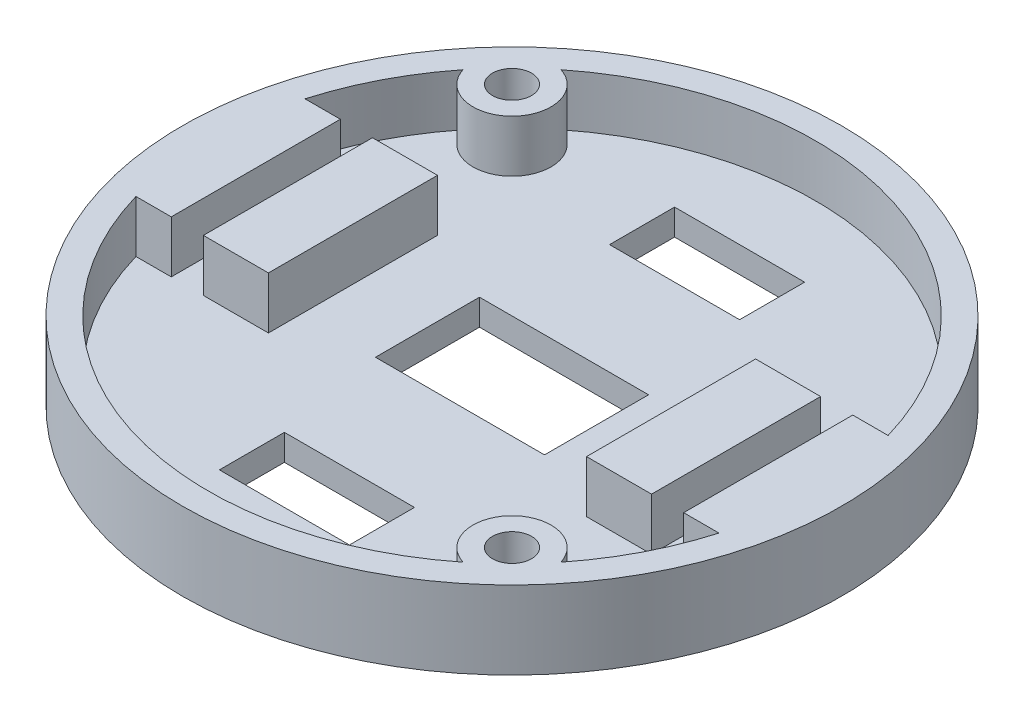
ISO-10303-21;
HEADER;
FILE_DESCRIPTION(('STEP AP214'),'2;1');
FILE_NAME('part.step','',(''),(''),'','','');
FILE_SCHEMA(('AUTOMOTIVE_DESIGN { 1 0 10303 214 1 1 1 1 }'));
ENDSEC;
DATA;
#1=APPLICATION_CONTEXT('core data for automotive mechanical design processes');
#2=APPLICATION_PROTOCOL_DEFINITION('international standard','automotive_design',2000,#1);
#3=PRODUCT_CONTEXT('',#1,'mechanical');
#4=PRODUCT('Part','Part','',(#3));
#5=PRODUCT_RELATED_PRODUCT_CATEGORY('part','',(#4));
#6=PRODUCT_DEFINITION_FORMATION('','',#4);
#7=PRODUCT_DEFINITION_CONTEXT('part definition',#1,'design');
#8=PRODUCT_DEFINITION('design','',#6,#7);
#9=PRODUCT_DEFINITION_SHAPE('','',#8);
#10=(LENGTH_UNIT() NAMED_UNIT(*) SI_UNIT(.MILLI.,.METRE.));
#11=(NAMED_UNIT(*) PLANE_ANGLE_UNIT() SI_UNIT($,.RADIAN.));
#12=(NAMED_UNIT(*) SI_UNIT($,.STERADIAN.) SOLID_ANGLE_UNIT());
#13=UNCERTAINTY_MEASURE_WITH_UNIT(LENGTH_MEASURE(1.E-05),#10,'distance_accuracy_value','');
#14=(GEOMETRIC_REPRESENTATION_CONTEXT(3) GLOBAL_UNCERTAINTY_ASSIGNED_CONTEXT((#13)) GLOBAL_UNIT_ASSIGNED_CONTEXT((#10,
#11,#12)) REPRESENTATION_CONTEXT('',''));
#15=CARTESIAN_POINT('',(0.,0.,0.));
#16=DIRECTION('',(0.,0.,1.));
#17=DIRECTION('',(1.,0.,0.));
#18=AXIS2_PLACEMENT_3D('',#15,#16,#17);
#19=CARTESIAN_POINT('',(0.,2.,0.));
#20=DIRECTION('',(0.,1.,0.));
#21=DIRECTION('',(0.,0.,1.));
#22=AXIS2_PLACEMENT_3D('',#19,#20,#21);
#23=PLANE('',#22);
#24=CARTESIAN_POINT('',(0.,2.,0.));
#25=DIRECTION('',(0.,1.,0.));
#26=DIRECTION('',(0.,0.,1.));
#27=AXIS2_PLACEMENT_3D('',#24,#25,#26);
#28=CIRCLE('',#27,23.34);
#29=CARTESIAN_POINT('',(-22.4166366790382,2.,6.5));
#30=VERTEX_POINT('',#29);
#31=CARTESIAN_POINT('',(14.5113899119544,2.,18.2804584959795));
#32=VERTEX_POINT('',#31);
#33=EDGE_CURVE('E569',#30,#32,#28,.T.);
#34=ORIENTED_EDGE('',*,*,#33,.T.);
#35=CARTESIAN_POINT('',(15.4219988976786,2.,15.4219988976786));
#36=DIRECTION('',(0.,-1.,0.));
#37=DIRECTION('',(0.,0.,1.));
#38=AXIS2_PLACEMENT_3D('',#35,#36,#37);
#39=CIRCLE('',#38,2.99999999999999);
#40=CARTESIAN_POINT('',(18.2804584959794,2.,14.5113899119544));
#41=VERTEX_POINT('',#40);
#42=EDGE_CURVE('E568',#32,#41,#39,.T.);
#43=ORIENTED_EDGE('',*,*,#42,.T.);
#44=CARTESIAN_POINT('',(0.,2.,0.));
#45=DIRECTION('',(0.,1.,0.));
#46=DIRECTION('',(0.,0.,1.));
#47=AXIS2_PLACEMENT_3D('',#44,#45,#46);
#48=CIRCLE('',#47,23.34);
#49=CARTESIAN_POINT('',(22.4166366790382,2.,6.5));
#50=VERTEX_POINT('',#49);
#51=EDGE_CURVE('E562',#41,#50,#48,.T.);
#52=ORIENTED_EDGE('',*,*,#51,.T.);
#53=DIRECTION('',(1.,0.,0.));
#54=VECTOR('',#53,1.);
#55=CARTESIAN_POINT('',(19.7,2.,6.5));
#56=LINE('',#55,#54);
#57=CARTESIAN_POINT('',(19.7,2.,6.5));
#58=VERTEX_POINT('',#57);
#59=EDGE_CURVE('E454',#58,#50,#56,.T.);
#60=ORIENTED_EDGE('',*,*,#59,.F.);
#61=DIRECTION('',(0.,0.,1.));
#62=VECTOR('',#61,1.);
#63=CARTESIAN_POINT('',(19.7,2.,-6.5));
#64=LINE('',#63,#62);
#65=CARTESIAN_POINT('',(19.7,2.,-6.5));
#66=VERTEX_POINT('',#65);
#67=EDGE_CURVE('E457',#66,#58,#64,.T.);
#68=ORIENTED_EDGE('',*,*,#67,.F.);
#69=DIRECTION('',(-1.,0.,0.));
#70=VECTOR('',#69,1.);
#71=CARTESIAN_POINT('',(22.4166366790382,2.,-6.5));
#72=LINE('',#71,#70);
#73=CARTESIAN_POINT('',(22.4166366790382,2.,-6.5));
#74=VERTEX_POINT('',#73);
#75=EDGE_CURVE('E461',#74,#66,#72,.T.);
#76=ORIENTED_EDGE('',*,*,#75,.F.);
#77=CARTESIAN_POINT('',(-14.5113899119544,2.,-18.2804584959795));
#78=VERTEX_POINT('',#77);
#79=EDGE_CURVE('E572',#74,#78,#48,.T.);
#80=ORIENTED_EDGE('',*,*,#79,.T.);
#81=CARTESIAN_POINT('',(-15.4219988976786,2.,-15.4219988976786));
#82=DIRECTION('',(0.,-1.,0.));
#83=DIRECTION('',(0.,0.,1.));
#84=AXIS2_PLACEMENT_3D('',#81,#82,#83);
#85=CIRCLE('',#84,3.);
#86=CARTESIAN_POINT('',(-18.2804584959794,2.,-14.5113899119544));
#87=VERTEX_POINT('',#86);
#88=EDGE_CURVE('E275',#78,#87,#85,.T.);
#89=ORIENTED_EDGE('',*,*,#88,.T.);
#90=CARTESIAN_POINT('',(-22.4166366790382,2.,-6.50000000000001));
#91=VERTEX_POINT('',#90);
#92=EDGE_CURVE('E565',#87,#91,#28,.T.);
#93=ORIENTED_EDGE('',*,*,#92,.T.);
#94=DIRECTION('',(-1.,0.,0.));
#95=VECTOR('',#94,1.);
#96=CARTESIAN_POINT('',(-22.4166366790382,2.,-6.5));
#97=LINE('',#96,#95);
#98=CARTESIAN_POINT('',(-19.7,2.,-6.49999999999999));
#99=VERTEX_POINT('',#98);
#100=EDGE_CURVE('E433',#99,#91,#97,.T.);
#101=ORIENTED_EDGE('',*,*,#100,.F.);
#102=DIRECTION('',(0.,0.,-1.));
#103=VECTOR('',#102,1.);
#104=CARTESIAN_POINT('',(-19.7,2.,-6.49999999999999));
#105=LINE('',#104,#103);
#106=CARTESIAN_POINT('',(-19.7,2.,6.5));
#107=VERTEX_POINT('',#106);
#108=EDGE_CURVE('E437',#107,#99,#105,.T.);
#109=ORIENTED_EDGE('',*,*,#108,.F.);
#110=DIRECTION('',(1.,0.,0.));
#111=VECTOR('',#110,1.);
#112=CARTESIAN_POINT('',(-19.7,2.,6.5));
#113=LINE('',#112,#111);
#114=EDGE_CURVE('E431',#30,#107,#113,.T.);
#115=ORIENTED_EDGE('',*,*,#114,.F.);
#116=EDGE_LOOP('',(#34,#43,#52,#60,#68,#76,#80,#89,#93,#101,#109,#115));
#117=FACE_BOUND('',#116,.T.);
#118=DIRECTION('',(0.,0.,1.));
#119=VECTOR('',#118,1.);
#120=CARTESIAN_POINT('',(-5.,2.,-17.5));
#121=LINE('',#120,#119);
#122=CARTESIAN_POINT('',(-5.,2.,-17.5));
#123=VERTEX_POINT('',#122);
#124=CARTESIAN_POINT('',(-5.,2.,-12.5));
#125=VERTEX_POINT('',#124);
#126=EDGE_CURVE('E56',#123,#125,#121,.T.);
#127=ORIENTED_EDGE('',*,*,#126,.F.);
#128=DIRECTION('',(-1.,0.,0.));
#129=VECTOR('',#128,1.);
#130=CARTESIAN_POINT('',(5.,2.,-17.5));
#131=LINE('',#130,#129);
#132=CARTESIAN_POINT('',(5.,2.,-17.5));
#133=VERTEX_POINT('',#132);
#134=EDGE_CURVE('E298',#133,#123,#131,.T.);
#135=ORIENTED_EDGE('',*,*,#134,.F.);
#136=DIRECTION('',(0.,0.,-1.));
#137=VECTOR('',#136,1.);
#138=CARTESIAN_POINT('',(5.,2.,-17.5));
#139=LINE('',#138,#137);
#140=CARTESIAN_POINT('',(5.,2.,-12.5));
#141=VERTEX_POINT('',#140);
#142=EDGE_CURVE('E312',#141,#133,#139,.T.);
#143=ORIENTED_EDGE('',*,*,#142,.F.);
#144=DIRECTION('',(1.,0.,0.));
#145=VECTOR('',#144,1.);
#146=CARTESIAN_POINT('',(5.,2.,-12.5));
#147=LINE('',#146,#145);
#148=EDGE_CURVE('E309',#125,#141,#147,.T.);
#149=ORIENTED_EDGE('',*,*,#148,.F.);
#150=EDGE_LOOP('',(#127,#135,#143,#149));
#151=FACE_BOUND('',#150,.T.);
#152=DIRECTION('',(0.,0.,-1.));
#153=VECTOR('',#152,1.);
#154=CARTESIAN_POINT('',(5.,2.,17.5));
#155=LINE('',#154,#153);
#156=CARTESIAN_POINT('',(5.,2.,17.5));
#157=VERTEX_POINT('',#156);
#158=CARTESIAN_POINT('',(5.,2.,12.5));
#159=VERTEX_POINT('',#158);
#160=EDGE_CURVE('E64',#157,#159,#155,.T.);
#161=ORIENTED_EDGE('',*,*,#160,.F.);
#162=DIRECTION('',(1.,0.,0.));
#163=VECTOR('',#162,1.);
#164=CARTESIAN_POINT('',(5.,2.,17.5));
#165=LINE('',#164,#163);
#166=CARTESIAN_POINT('',(-5.,2.,17.5));
#167=VERTEX_POINT('',#166);
#168=EDGE_CURVE('E335',#167,#157,#165,.T.);
#169=ORIENTED_EDGE('',*,*,#168,.F.);
#170=DIRECTION('',(0.,0.,1.));
#171=VECTOR('',#170,1.);
#172=CARTESIAN_POINT('',(-5.,2.,17.5));
#173=LINE('',#172,#171);
#174=CARTESIAN_POINT('',(-5.,2.,12.5));
#175=VERTEX_POINT('',#174);
#176=EDGE_CURVE('E338',#175,#167,#173,.T.);
#177=ORIENTED_EDGE('',*,*,#176,.F.);
#178=DIRECTION('',(-1.,0.,0.));
#179=VECTOR('',#178,1.);
#180=CARTESIAN_POINT('',(5.,2.,12.5));
#181=LINE('',#180,#179);
#182=EDGE_CURVE('E342',#159,#175,#181,.T.);
#183=ORIENTED_EDGE('',*,*,#182,.F.);
#184=EDGE_LOOP('',(#161,#169,#177,#183));
#185=FACE_BOUND('',#184,.T.);
#186=DIRECTION('',(0.,0.,1.));
#187=VECTOR('',#186,1.);
#188=CARTESIAN_POINT('',(-6.5,2.,-4.));
#189=LINE('',#188,#187);
#190=CARTESIAN_POINT('',(-6.5,2.,-4.));
#191=VERTEX_POINT('',#190);
#192=CARTESIAN_POINT('',(-6.5,2.,4.));
#193=VERTEX_POINT('',#192);
#194=EDGE_CURVE('E334',#191,#193,#189,.T.);
#195=ORIENTED_EDGE('',*,*,#194,.F.);
#196=DIRECTION('',(-1.,0.,0.));
#197=VECTOR('',#196,1.);
#198=CARTESIAN_POINT('',(6.5,2.,-4.));
#199=LINE('',#198,#197);
#200=CARTESIAN_POINT('',(6.5,2.,-4.));
#201=VERTEX_POINT('',#200);
#202=EDGE_CURVE('E365',#201,#191,#199,.T.);
#203=ORIENTED_EDGE('',*,*,#202,.F.);
#204=DIRECTION('',(0.,0.,-1.));
#205=VECTOR('',#204,1.);
#206=CARTESIAN_POINT('',(6.5,2.,-4.));
#207=LINE('',#206,#205);
#208=CARTESIAN_POINT('',(6.5,2.,4.));
#209=VERTEX_POINT('',#208);
#210=EDGE_CURVE('E368',#209,#201,#207,.T.);
#211=ORIENTED_EDGE('',*,*,#210,.F.);
#212=DIRECTION('',(1.,0.,0.));
#213=VECTOR('',#212,1.);
#214=CARTESIAN_POINT('',(6.5,2.,4.));
#215=LINE('',#214,#213);
#216=EDGE_CURVE('E372',#193,#209,#215,.T.);
#217=ORIENTED_EDGE('',*,*,#216,.F.);
#218=EDGE_LOOP('',(#195,#203,#211,#217));
#219=FACE_BOUND('',#218,.T.);
#220=DIRECTION('',(1.,0.,0.));
#221=VECTOR('',#220,1.);
#222=CARTESIAN_POINT('',(12.23,2.,6.5));
#223=LINE('',#222,#221);
#224=CARTESIAN_POINT('',(12.23,2.,6.5));
#225=VERTEX_POINT('',#224);
#226=CARTESIAN_POINT('',(17.23,2.,6.5));
#227=VERTEX_POINT('',#226);
#228=EDGE_CURVE('E481',#225,#227,#223,.T.);
#229=ORIENTED_EDGE('',*,*,#228,.F.);
#230=DIRECTION('',(0.,0.,1.));
#231=VECTOR('',#230,1.);
#232=CARTESIAN_POINT('',(12.23,2.,6.5));
#233=LINE('',#232,#231);
#234=CARTESIAN_POINT('',(12.23,2.,-6.5));
#235=VERTEX_POINT('',#234);
#236=EDGE_CURVE('E463',#235,#225,#233,.T.);
#237=ORIENTED_EDGE('',*,*,#236,.F.);
#238=DIRECTION('',(-1.,0.,0.));
#239=VECTOR('',#238,1.);
#240=CARTESIAN_POINT('',(12.23,2.,-6.5));
#241=LINE('',#240,#239);
#242=CARTESIAN_POINT('',(17.23,2.,-6.5));
#243=VERTEX_POINT('',#242);
#244=EDGE_CURVE('E472',#243,#235,#241,.T.);
#245=ORIENTED_EDGE('',*,*,#244,.F.);
#246=DIRECTION('',(0.,0.,-1.));
#247=VECTOR('',#246,1.);
#248=CARTESIAN_POINT('',(17.23,2.,6.5));
#249=LINE('',#248,#247);
#250=EDGE_CURVE('E483',#227,#243,#249,.T.);
#251=ORIENTED_EDGE('',*,*,#250,.F.);
#252=EDGE_LOOP('',(#229,#237,#245,#251));
#253=FACE_BOUND('',#252,.T.);
#254=DIRECTION('',(-1.,0.,0.));
#255=VECTOR('',#254,1.);
#256=CARTESIAN_POINT('',(-12.23,2.,-6.49999999999999));
#257=LINE('',#256,#255);
#258=CARTESIAN_POINT('',(-12.23,2.,-6.49999999999999));
#259=VERTEX_POINT('',#258);
#260=CARTESIAN_POINT('',(-17.23,2.,-6.49999999999999));
#261=VERTEX_POINT('',#260);
#262=EDGE_CURVE('E408',#259,#261,#257,.T.);
#263=ORIENTED_EDGE('',*,*,#262,.F.);
#264=DIRECTION('',(0.,0.,-1.));
#265=VECTOR('',#264,1.);
#266=CARTESIAN_POINT('',(-12.23,2.,6.5));
#267=LINE('',#266,#265);
#268=CARTESIAN_POINT('',(-12.23,2.,6.5));
#269=VERTEX_POINT('',#268);
#270=EDGE_CURVE('E410',#269,#259,#267,.T.);
#271=ORIENTED_EDGE('',*,*,#270,.F.);
#272=DIRECTION('',(1.,0.,0.));
#273=VECTOR('',#272,1.);
#274=CARTESIAN_POINT('',(-12.23,2.,6.5));
#275=LINE('',#274,#273);
#276=CARTESIAN_POINT('',(-17.23,2.,6.5));
#277=VERTEX_POINT('',#276);
#278=EDGE_CURVE('E402',#277,#269,#275,.T.);
#279=ORIENTED_EDGE('',*,*,#278,.F.);
#280=DIRECTION('',(0.,0.,1.));
#281=VECTOR('',#280,1.);
#282=CARTESIAN_POINT('',(-17.23,2.,6.5));
#283=LINE('',#282,#281);
#284=EDGE_CURVE('E404',#261,#277,#283,.T.);
#285=ORIENTED_EDGE('',*,*,#284,.F.);
#286=EDGE_LOOP('',(#263,#271,#279,#285));
#287=FACE_BOUND('',#286,.T.);
#288=ADVANCED_FACE('F41',(#117,#151,#185,#219,#253,#287),#23,.T.);
#289=CARTESIAN_POINT('',(0.,2.,0.));
#290=DIRECTION('',(0.,-1.,0.));
#291=DIRECTION('',(0.,0.,-1.));
#292=AXIS2_PLACEMENT_3D('',#289,#290,#291);
#293=CYLINDRICAL_SURFACE('',#292,25.34);
#294=CARTESIAN_POINT('',(0.,0.,0.));
#295=DIRECTION('',(0.,1.,0.));
#296=DIRECTION('',(0.,0.,1.));
#297=AXIS2_PLACEMENT_3D('',#294,#295,#296);
#298=CIRCLE('',#297,25.34);
#299=CARTESIAN_POINT('',(0.,0.,25.34));
#300=VERTEX_POINT('',#299);
#301=EDGE_CURVE('E11',#300,#300,#298,.T.);
#302=ORIENTED_EDGE('',*,*,#301,.T.);
#303=EDGE_LOOP('',(#302));
#304=FACE_BOUND('',#303,.T.);
#305=CARTESIAN_POINT('',(0.,6.00000000000001,0.));
#306=DIRECTION('',(0.,-1.,0.));
#307=DIRECTION('',(0.,0.,-1.));
#308=AXIS2_PLACEMENT_3D('',#305,#306,#307);
#309=CIRCLE('',#308,25.34);
#310=CARTESIAN_POINT('',(0.,6.00000000000001,-25.34));
#311=VERTEX_POINT('',#310);
#312=EDGE_CURVE('E559',#311,#311,#309,.T.);
#313=ORIENTED_EDGE('',*,*,#312,.T.);
#314=EDGE_LOOP('',(#313));
#315=FACE_BOUND('',#314,.T.);
#316=ADVANCED_FACE('F43',(#304,#315),#293,.T.);
#317=CARTESIAN_POINT('',(0.,0.,0.));
#318=DIRECTION('',(0.,1.,0.));
#319=DIRECTION('',(0.,0.,1.));
#320=AXIS2_PLACEMENT_3D('',#317,#318,#319);
#321=PLANE('',#320);
#322=DIRECTION('',(-1.,0.,0.));
#323=VECTOR('',#322,1.);
#324=CARTESIAN_POINT('',(5.,0.,-17.5));
#325=LINE('',#324,#323);
#326=CARTESIAN_POINT('',(5.,0.,-17.5));
#327=VERTEX_POINT('',#326);
#328=CARTESIAN_POINT('',(-5.,0.,-17.5));
#329=VERTEX_POINT('',#328);
#330=EDGE_CURVE('E304',#327,#329,#325,.T.);
#331=ORIENTED_EDGE('',*,*,#330,.T.);
#332=DIRECTION('',(0.,0.,1.));
#333=VECTOR('',#332,1.);
#334=CARTESIAN_POINT('',(-5.,0.,-17.5));
#335=LINE('',#334,#333);
#336=CARTESIAN_POINT('',(-5.,0.,-12.5));
#337=VERTEX_POINT('',#336);
#338=EDGE_CURVE('E294',#329,#337,#335,.T.);
#339=ORIENTED_EDGE('',*,*,#338,.T.);
#340=DIRECTION('',(1.,0.,0.));
#341=VECTOR('',#340,1.);
#342=CARTESIAN_POINT('',(5.,0.,-12.5));
#343=LINE('',#342,#341);
#344=CARTESIAN_POINT('',(5.,0.,-12.5));
#345=VERTEX_POINT('',#344);
#346=EDGE_CURVE('E297',#337,#345,#343,.T.);
#347=ORIENTED_EDGE('',*,*,#346,.T.);
#348=DIRECTION('',(0.,0.,-1.));
#349=VECTOR('',#348,1.);
#350=CARTESIAN_POINT('',(5.,0.,-17.5));
#351=LINE('',#350,#349);
#352=EDGE_CURVE('E301',#345,#327,#351,.T.);
#353=ORIENTED_EDGE('',*,*,#352,.T.);
#354=EDGE_LOOP('',(#331,#339,#347,#353));
#355=FACE_BOUND('',#354,.T.);
#356=DIRECTION('',(1.,0.,0.));
#357=VECTOR('',#356,1.);
#358=CARTESIAN_POINT('',(5.,0.,17.5));
#359=LINE('',#358,#357);
#360=CARTESIAN_POINT('',(-5.,0.,17.5));
#361=VERTEX_POINT('',#360);
#362=CARTESIAN_POINT('',(5.,0.,17.5));
#363=VERTEX_POINT('',#362);
#364=EDGE_CURVE('E327',#361,#363,#359,.T.);
#365=ORIENTED_EDGE('',*,*,#364,.T.);
#366=DIRECTION('',(0.,0.,-1.));
#367=VECTOR('',#366,1.);
#368=CARTESIAN_POINT('',(5.,0.,17.5));
#369=LINE('',#368,#367);
#370=CARTESIAN_POINT('',(5.,0.,12.5));
#371=VERTEX_POINT('',#370);
#372=EDGE_CURVE('E339',#363,#371,#369,.T.);
#373=ORIENTED_EDGE('',*,*,#372,.T.);
#374=DIRECTION('',(-1.,0.,0.));
#375=VECTOR('',#374,1.);
#376=CARTESIAN_POINT('',(5.,0.,12.5));
#377=LINE('',#376,#375);
#378=CARTESIAN_POINT('',(-5.,0.,12.5));
#379=VERTEX_POINT('',#378);
#380=EDGE_CURVE('E351',#371,#379,#377,.T.);
#381=ORIENTED_EDGE('',*,*,#380,.T.);
#382=DIRECTION('',(0.,0.,1.));
#383=VECTOR('',#382,1.);
#384=CARTESIAN_POINT('',(-5.,0.,17.5));
#385=LINE('',#384,#383);
#386=EDGE_CURVE('E348',#379,#361,#385,.T.);
#387=ORIENTED_EDGE('',*,*,#386,.T.);
#388=EDGE_LOOP('',(#365,#373,#381,#387));
#389=FACE_BOUND('',#388,.T.);
#390=DIRECTION('',(-1.,0.,0.));
#391=VECTOR('',#390,1.);
#392=CARTESIAN_POINT('',(6.5,0.,-4.));
#393=LINE('',#392,#391);
#394=CARTESIAN_POINT('',(6.5,0.,-4.));
#395=VERTEX_POINT('',#394);
#396=CARTESIAN_POINT('',(-6.5,0.,-4.));
#397=VERTEX_POINT('',#396);
#398=EDGE_CURVE('E359',#395,#397,#393,.T.);
#399=ORIENTED_EDGE('',*,*,#398,.T.);
#400=DIRECTION('',(0.,0.,1.));
#401=VECTOR('',#400,1.);
#402=CARTESIAN_POINT('',(-6.5,0.,-4.));
#403=LINE('',#402,#401);
#404=CARTESIAN_POINT('',(-6.5,0.,4.));
#405=VERTEX_POINT('',#404);
#406=EDGE_CURVE('E369',#397,#405,#403,.T.);
#407=ORIENTED_EDGE('',*,*,#406,.T.);
#408=DIRECTION('',(1.,0.,0.));
#409=VECTOR('',#408,1.);
#410=CARTESIAN_POINT('',(6.5,0.,4.));
#411=LINE('',#410,#409);
#412=CARTESIAN_POINT('',(6.5,0.,4.));
#413=VERTEX_POINT('',#412);
#414=EDGE_CURVE('E381',#405,#413,#411,.T.);
#415=ORIENTED_EDGE('',*,*,#414,.T.);
#416=DIRECTION('',(0.,0.,-1.));
#417=VECTOR('',#416,1.);
#418=CARTESIAN_POINT('',(6.5,0.,-4.));
#419=LINE('',#418,#417);
#420=EDGE_CURVE('E378',#413,#395,#419,.T.);
#421=ORIENTED_EDGE('',*,*,#420,.T.);
#422=EDGE_LOOP('',(#399,#407,#415,#421));
#423=FACE_BOUND('',#422,.T.);
#424=CARTESIAN_POINT('',(-15.4219988976786,0.,-15.4219988976786));
#425=DIRECTION('',(0.,1.,0.));
#426=DIRECTION('',(0.,0.,1.));
#427=AXIS2_PLACEMENT_3D('',#424,#425,#426);
#428=CIRCLE('',#427,1.5);
#429=CARTESIAN_POINT('',(-15.4219988976786,0.,-13.9219988976786));
#430=VERTEX_POINT('',#429);
#431=EDGE_CURVE('E386',#430,#430,#428,.T.);
#432=ORIENTED_EDGE('',*,*,#431,.T.);
#433=EDGE_LOOP('',(#432));
#434=FACE_BOUND('',#433,.T.);
#435=CARTESIAN_POINT('',(15.4219988976786,0.,15.4219988976786));
#436=DIRECTION('',(0.,1.,0.));
#437=DIRECTION('',(0.,0.,1.));
#438=AXIS2_PLACEMENT_3D('',#435,#436,#437);
#439=CIRCLE('',#438,1.5);
#440=CARTESIAN_POINT('',(15.4219988976786,0.,16.9219988976786));
#441=VERTEX_POINT('',#440);
#442=EDGE_CURVE('E319',#441,#441,#439,.T.);
#443=ORIENTED_EDGE('',*,*,#442,.T.);
#444=EDGE_LOOP('',(#443));
#445=FACE_BOUND('',#444,.T.);
#446=ORIENTED_EDGE('',*,*,#301,.F.);
#447=EDGE_LOOP('',(#446));
#448=FACE_BOUND('',#447,.T.);
#449=ADVANCED_FACE('F532',(#355,#389,#423,#434,#445,#448),#321,.F.);
#450=CARTESIAN_POINT('',(12.23,6.,6.5));
#451=DIRECTION('',(1.,0.,0.));
#452=DIRECTION('',(0.,0.,-1.));
#453=AXIS2_PLACEMENT_3D('',#450,#451,#452);
#454=PLANE('',#453);
#455=ORIENTED_EDGE('',*,*,#236,.T.);
#456=DIRECTION('',(0.,-1.,0.));
#457=VECTOR('',#456,1.);
#458=CARTESIAN_POINT('',(12.23,6.,6.5));
#459=LINE('',#458,#457);
#460=CARTESIAN_POINT('',(12.23,6.,6.5));
#461=VERTEX_POINT('',#460);
#462=EDGE_CURVE('E49',#461,#225,#459,.T.);
#463=ORIENTED_EDGE('',*,*,#462,.F.);
#464=DIRECTION('',(0.,0.,1.));
#465=VECTOR('',#464,1.);
#466=CARTESIAN_POINT('',(12.23,6.,6.5));
#467=LINE('',#466,#465);
#468=CARTESIAN_POINT('',(12.23,6.,-6.5));
#469=VERTEX_POINT('',#468);
#470=EDGE_CURVE('E468',#469,#461,#467,.T.);
#471=ORIENTED_EDGE('',*,*,#470,.F.);
#472=DIRECTION('',(0.,-1.,0.));
#473=VECTOR('',#472,1.);
#474=CARTESIAN_POINT('',(12.23,6.,-6.5));
#475=LINE('',#474,#473);
#476=EDGE_CURVE('E478',#469,#235,#475,.T.);
#477=ORIENTED_EDGE('',*,*,#476,.T.);
#478=EDGE_LOOP('',(#455,#463,#471,#477));
#479=FACE_BOUND('',#478,.T.);
#480=ADVANCED_FACE('F501',(#479),#454,.F.);
#481=CARTESIAN_POINT('',(12.23,6.,6.5));
#482=DIRECTION('',(0.,0.,-1.));
#483=DIRECTION('',(-1.,0.,0.));
#484=AXIS2_PLACEMENT_3D('',#481,#482,#483);
#485=PLANE('',#484);
#486=ORIENTED_EDGE('',*,*,#228,.T.);
#487=DIRECTION('',(0.,-1.,0.));
#488=VECTOR('',#487,1.);
#489=CARTESIAN_POINT('',(17.23,6.,6.5));
#490=LINE('',#489,#488);
#491=CARTESIAN_POINT('',(17.23,6.,6.5));
#492=VERTEX_POINT('',#491);
#493=EDGE_CURVE('E491',#492,#227,#490,.T.);
#494=ORIENTED_EDGE('',*,*,#493,.F.);
#495=DIRECTION('',(1.,0.,0.));
#496=VECTOR('',#495,1.);
#497=CARTESIAN_POINT('',(12.23,6.,6.5));
#498=LINE('',#497,#496);
#499=EDGE_CURVE('E471',#461,#492,#498,.T.);
#500=ORIENTED_EDGE('',*,*,#499,.F.);
#501=ORIENTED_EDGE('',*,*,#462,.T.);
#502=EDGE_LOOP('',(#486,#494,#500,#501));
#503=FACE_BOUND('',#502,.T.);
#504=ADVANCED_FACE('F495',(#503),#485,.F.);
#505=CARTESIAN_POINT('',(17.23,6.,6.5));
#506=DIRECTION('',(-1.,0.,0.));
#507=DIRECTION('',(0.,0.,1.));
#508=AXIS2_PLACEMENT_3D('',#505,#506,#507);
#509=PLANE('',#508);
#510=ORIENTED_EDGE('',*,*,#250,.T.);
#511=DIRECTION('',(0.,-1.,0.));
#512=VECTOR('',#511,1.);
#513=CARTESIAN_POINT('',(17.23,6.,-6.5));
#514=LINE('',#513,#512);
#515=CARTESIAN_POINT('',(17.23,6.,-6.5));
#516=VERTEX_POINT('',#515);
#517=EDGE_CURVE('E489',#516,#243,#514,.T.);
#518=ORIENTED_EDGE('',*,*,#517,.F.);
#519=DIRECTION('',(0.,0.,-1.));
#520=VECTOR('',#519,1.);
#521=CARTESIAN_POINT('',(17.23,6.,6.5));
#522=LINE('',#521,#520);
#523=EDGE_CURVE('E474',#492,#516,#522,.T.);
#524=ORIENTED_EDGE('',*,*,#523,.F.);
#525=ORIENTED_EDGE('',*,*,#493,.T.);
#526=EDGE_LOOP('',(#510,#518,#524,#525));
#527=FACE_BOUND('',#526,.T.);
#528=ADVANCED_FACE('F509',(#527),#509,.F.);
#529=CARTESIAN_POINT('',(12.23,6.,-6.5));
#530=DIRECTION('',(0.,0.,1.));
#531=DIRECTION('',(1.,0.,0.));
#532=AXIS2_PLACEMENT_3D('',#529,#530,#531);
#533=PLANE('',#532);
#534=ORIENTED_EDGE('',*,*,#244,.T.);
#535=ORIENTED_EDGE('',*,*,#476,.F.);
#536=DIRECTION('',(-1.,0.,0.));
#537=VECTOR('',#536,1.);
#538=CARTESIAN_POINT('',(12.23,6.,-6.5));
#539=LINE('',#538,#537);
#540=EDGE_CURVE('E476',#516,#469,#539,.T.);
#541=ORIENTED_EDGE('',*,*,#540,.F.);
#542=ORIENTED_EDGE('',*,*,#517,.T.);
#543=EDGE_LOOP('',(#534,#535,#541,#542));
#544=FACE_BOUND('',#543,.T.);
#545=ADVANCED_FACE('F515',(#544),#533,.F.);
#546=CARTESIAN_POINT('',(0.,6.,0.));
#547=DIRECTION('',(0.,-1.,0.));
#548=DIRECTION('',(0.,0.,-1.));
#549=AXIS2_PLACEMENT_3D('',#546,#547,#548);
#550=PLANE('',#549);
#551=ORIENTED_EDGE('',*,*,#470,.T.);
#552=ORIENTED_EDGE('',*,*,#499,.T.);
#553=ORIENTED_EDGE('',*,*,#523,.T.);
#554=ORIENTED_EDGE('',*,*,#540,.T.);
#555=EDGE_LOOP('',(#551,#552,#553,#554));
#556=FACE_BOUND('',#555,.T.);
#557=ADVANCED_FACE('F513',(#556),#550,.F.);
#558=CARTESIAN_POINT('',(22.4166366790382,6.,-6.5));
#559=DIRECTION('',(0.,0.,1.));
#560=DIRECTION('',(1.,0.,0.));
#561=AXIS2_PLACEMENT_3D('',#558,#559,#560);
#562=PLANE('',#561);
#563=ORIENTED_EDGE('',*,*,#75,.T.);
#564=DIRECTION('',(0.,-1.,0.));
#565=VECTOR('',#564,1.);
#566=CARTESIAN_POINT('',(19.7,6.,-6.5));
#567=LINE('',#566,#565);
#568=CARTESIAN_POINT('',(19.7,6.,-6.5));
#569=VERTEX_POINT('',#568);
#570=EDGE_CURVE('E446',#569,#66,#567,.T.);
#571=ORIENTED_EDGE('',*,*,#570,.F.);
#572=DIRECTION('',(-1.,0.,0.));
#573=VECTOR('',#572,1.);
#574=CARTESIAN_POINT('',(22.4166366790382,6.,-6.5));
#575=LINE('',#574,#573);
#576=CARTESIAN_POINT('',(22.4166366790382,6.00000000000001,-6.5));
#577=VERTEX_POINT('',#576);
#578=EDGE_CURVE('E458',#577,#569,#575,.T.);
#579=ORIENTED_EDGE('',*,*,#578,.F.);
#580=DIRECTION('',(0.,-1.,0.));
#581=VECTOR('',#580,1.);
#582=CARTESIAN_POINT('',(22.4166366790382,6.,-6.5));
#583=LINE('',#582,#581);
#584=EDGE_CURVE('E270',#577,#74,#583,.T.);
#585=ORIENTED_EDGE('',*,*,#584,.T.);
#586=EDGE_LOOP('',(#563,#571,#579,#585));
#587=FACE_BOUND('',#586,.T.);
#588=ADVANCED_FACE('F522',(#587),#562,.F.);
#589=CARTESIAN_POINT('',(19.7,6.,-6.5));
#590=DIRECTION('',(1.,0.,0.));
#591=DIRECTION('',(0.,0.,-1.));
#592=AXIS2_PLACEMENT_3D('',#589,#590,#591);
#593=PLANE('',#592);
#594=ORIENTED_EDGE('',*,*,#67,.T.);
#595=DIRECTION('',(0.,-1.,0.));
#596=VECTOR('',#595,1.);
#597=CARTESIAN_POINT('',(19.7,6.,6.5));
#598=LINE('',#597,#596);
#599=CARTESIAN_POINT('',(19.7,6.,6.5));
#600=VERTEX_POINT('',#599);
#601=EDGE_CURVE('E449',#600,#58,#598,.T.);
#602=ORIENTED_EDGE('',*,*,#601,.F.);
#603=DIRECTION('',(0.,0.,1.));
#604=VECTOR('',#603,1.);
#605=CARTESIAN_POINT('',(19.7,6.,-6.5));
#606=LINE('',#605,#604);
#607=EDGE_CURVE('E465',#569,#600,#606,.T.);
#608=ORIENTED_EDGE('',*,*,#607,.F.);
#609=ORIENTED_EDGE('',*,*,#570,.T.);
#610=EDGE_LOOP('',(#594,#602,#608,#609));
#611=FACE_BOUND('',#610,.T.);
#612=ADVANCED_FACE('F585',(#611),#593,.F.);
#613=CARTESIAN_POINT('',(19.7,6.,6.5));
#614=DIRECTION('',(0.,0.,-1.));
#615=DIRECTION('',(-1.,0.,0.));
#616=AXIS2_PLACEMENT_3D('',#613,#614,#615);
#617=PLANE('',#616);
#618=ORIENTED_EDGE('',*,*,#59,.T.);
#619=DIRECTION('',(0.,-1.,0.));
#620=VECTOR('',#619,1.);
#621=CARTESIAN_POINT('',(22.4166366790382,6.,6.5));
#622=LINE('',#621,#620);
#623=CARTESIAN_POINT('',(22.4166366790382,6.00000000000001,6.5));
#624=VERTEX_POINT('',#623);
#625=EDGE_CURVE('E451',#624,#50,#622,.T.);
#626=ORIENTED_EDGE('',*,*,#625,.F.);
#627=DIRECTION('',(1.,0.,0.));
#628=VECTOR('',#627,1.);
#629=CARTESIAN_POINT('',(19.7,6.,6.5));
#630=LINE('',#629,#628);
#631=EDGE_CURVE('E453',#600,#624,#630,.T.);
#632=ORIENTED_EDGE('',*,*,#631,.F.);
#633=ORIENTED_EDGE('',*,*,#601,.T.);
#634=EDGE_LOOP('',(#618,#626,#632,#633));
#635=FACE_BOUND('',#634,.T.);
#636=ADVANCED_FACE('F587',(#635),#617,.F.);
#637=CARTESIAN_POINT('',(0.,6.,0.));
#638=DIRECTION('',(0.,1.,0.));
#639=DIRECTION('',(0.,0.,1.));
#640=AXIS2_PLACEMENT_3D('',#637,#638,#639);
#641=PLANE('',#640);
#642=ORIENTED_EDGE('',*,*,#631,.T.);
#643=CARTESIAN_POINT('',(0.,6.00000000000001,0.));
#644=DIRECTION('',(0.,-1.,0.));
#645=DIRECTION('',(0.,0.,-1.));
#646=AXIS2_PLACEMENT_3D('',#643,#644,#645);
#647=CIRCLE('',#646,23.34);
#648=CARTESIAN_POINT('',(18.2804584959794,6.00000000000001,14.5113899119544));
#649=VERTEX_POINT('',#648);
#650=EDGE_CURVE('E262',#624,#649,#647,.T.);
#651=ORIENTED_EDGE('',*,*,#650,.T.);
#652=CARTESIAN_POINT('',(15.4219988976786,6.00000000000001,15.4219988976786));
#653=DIRECTION('',(0.,-1.,0.));
#654=DIRECTION('',(0.,0.,-1.));
#655=AXIS2_PLACEMENT_3D('',#652,#653,#654);
#656=CIRCLE('',#655,2.99999999999999);
#657=CARTESIAN_POINT('',(14.5113899119544,6.00000000000001,18.2804584959795));
#658=VERTEX_POINT('',#657);
#659=EDGE_CURVE('E271',#649,#658,#656,.F.);
#660=ORIENTED_EDGE('',*,*,#659,.T.);
#661=CARTESIAN_POINT('',(0.,6.00000000000001,0.));
#662=DIRECTION('',(0.,-1.,0.));
#663=DIRECTION('',(0.,0.,-1.));
#664=AXIS2_PLACEMENT_3D('',#661,#662,#663);
#665=CIRCLE('',#664,23.34);
#666=CARTESIAN_POINT('',(-22.4166366790382,6.,6.5));
#667=VERTEX_POINT('',#666);
#668=EDGE_CURVE('E263',#658,#667,#665,.T.);
#669=ORIENTED_EDGE('',*,*,#668,.T.);
#670=DIRECTION('',(1.,0.,0.));
#671=VECTOR('',#670,1.);
#672=CARTESIAN_POINT('',(-19.7,6.,6.5));
#673=LINE('',#672,#671);
#674=CARTESIAN_POINT('',(-19.7,6.,6.5));
#675=VERTEX_POINT('',#674);
#676=EDGE_CURVE('E430',#667,#675,#673,.T.);
#677=ORIENTED_EDGE('',*,*,#676,.T.);
#678=DIRECTION('',(0.,0.,-1.));
#679=VECTOR('',#678,1.);
#680=CARTESIAN_POINT('',(-19.7,6.,-6.49999999999999));
#681=LINE('',#680,#679);
#682=CARTESIAN_POINT('',(-19.7,6.,-6.49999999999999));
#683=VERTEX_POINT('',#682);
#684=EDGE_CURVE('E434',#675,#683,#681,.T.);
#685=ORIENTED_EDGE('',*,*,#684,.T.);
#686=DIRECTION('',(-1.,0.,0.));
#687=VECTOR('',#686,1.);
#688=CARTESIAN_POINT('',(-22.4166366790382,6.,-6.5));
#689=LINE('',#688,#687);
#690=CARTESIAN_POINT('',(-22.4166366790382,6.00000000000001,-6.5));
#691=VERTEX_POINT('',#690);
#692=EDGE_CURVE('E441',#683,#691,#689,.T.);
#693=ORIENTED_EDGE('',*,*,#692,.T.);
#694=CARTESIAN_POINT('',(-18.2804584959794,6.00000000000001,-14.5113899119544));
#695=VERTEX_POINT('',#694);
#696=EDGE_CURVE('E258',#691,#695,#665,.T.);
#697=ORIENTED_EDGE('',*,*,#696,.T.);
#698=CARTESIAN_POINT('',(-15.4219988976786,6.00000000000001,-15.4219988976786));
#699=DIRECTION('',(0.,-1.,0.));
#700=DIRECTION('',(0.,0.,-1.));
#701=AXIS2_PLACEMENT_3D('',#698,#699,#700);
#702=CIRCLE('',#701,3.);
#703=CARTESIAN_POINT('',(-14.5113899119544,6.00000000000001,-18.2804584959795));
#704=VERTEX_POINT('',#703);
#705=EDGE_CURVE('E250',#695,#704,#702,.F.);
#706=ORIENTED_EDGE('',*,*,#705,.T.);
#707=EDGE_CURVE('E255',#704,#577,#647,.T.);
#708=ORIENTED_EDGE('',*,*,#707,.T.);
#709=ORIENTED_EDGE('',*,*,#578,.T.);
#710=ORIENTED_EDGE('',*,*,#607,.T.);
#711=EDGE_LOOP('',(#642,#651,#660,#669,#677,#685,#693,#697,#706,#708,#709,#710));
#712=FACE_BOUND('',#711,.T.);
#713=CARTESIAN_POINT('',(15.4219988976786,6.00000000000001,15.4219988976786));
#714=DIRECTION('',(0.,-1.,0.));
#715=DIRECTION('',(0.,0.,-1.));
#716=AXIS2_PLACEMENT_3D('',#713,#714,#715);
#717=CIRCLE('',#716,1.5);
#718=CARTESIAN_POINT('',(15.4219988976786,6.00000000000001,13.9219988976786));
#719=VERTEX_POINT('',#718);
#720=EDGE_CURVE('E280',#719,#719,#717,.T.);
#721=ORIENTED_EDGE('',*,*,#720,.T.);
#722=EDGE_LOOP('',(#721));
#723=FACE_BOUND('',#722,.T.);
#724=CARTESIAN_POINT('',(-15.4219988976786,6.00000000000001,-15.4219988976786));
#725=DIRECTION('',(0.,-1.,0.));
#726=DIRECTION('',(0.,0.,-1.));
#727=AXIS2_PLACEMENT_3D('',#724,#725,#726);
#728=CIRCLE('',#727,1.5);
#729=CARTESIAN_POINT('',(-15.4219988976786,6.00000000000001,-16.9219988976786));
#730=VERTEX_POINT('',#729);
#731=EDGE_CURVE('E289',#730,#730,#728,.T.);
#732=ORIENTED_EDGE('',*,*,#731,.T.);
#733=EDGE_LOOP('',(#732));
#734=FACE_BOUND('',#733,.T.);
#735=ORIENTED_EDGE('',*,*,#312,.F.);
#736=EDGE_LOOP('',(#735));
#737=FACE_BOUND('',#736,.T.);
#738=ADVANCED_FACE('F253',(#712,#723,#734,#737),#641,.T.);
#739=CARTESIAN_POINT('',(-19.7,6.,-6.49999999999999));
#740=DIRECTION('',(-1.,0.,0.));
#741=DIRECTION('',(0.,0.,1.));
#742=AXIS2_PLACEMENT_3D('',#739,#740,#741);
#743=PLANE('',#742);
#744=ORIENTED_EDGE('',*,*,#108,.T.);
#745=DIRECTION('',(0.,-1.,0.));
#746=VECTOR('',#745,1.);
#747=CARTESIAN_POINT('',(-19.7,6.,-6.49999999999999));
#748=LINE('',#747,#746);
#749=EDGE_CURVE('E413',#683,#99,#748,.T.);
#750=ORIENTED_EDGE('',*,*,#749,.F.);
#751=ORIENTED_EDGE('',*,*,#684,.F.);
#752=DIRECTION('',(0.,-1.,0.));
#753=VECTOR('',#752,1.);
#754=CARTESIAN_POINT('',(-19.7,6.,6.5));
#755=LINE('',#754,#753);
#756=EDGE_CURVE('E427',#675,#107,#755,.T.);
#757=ORIENTED_EDGE('',*,*,#756,.T.);
#758=EDGE_LOOP('',(#744,#750,#751,#757));
#759=FACE_BOUND('',#758,.T.);
#760=ADVANCED_FACE('F609',(#759),#743,.F.);
#761=CARTESIAN_POINT('',(-22.4166366790382,6.,-6.5));
#762=DIRECTION('',(0.,0.,1.));
#763=DIRECTION('',(1.,0.,0.));
#764=AXIS2_PLACEMENT_3D('',#761,#762,#763);
#765=PLANE('',#764);
#766=ORIENTED_EDGE('',*,*,#100,.T.);
#767=DIRECTION('',(0.,-1.,0.));
#768=VECTOR('',#767,1.);
#769=CARTESIAN_POINT('',(-22.4166366790382,6.,-6.50000000000001));
#770=LINE('',#769,#768);
#771=EDGE_CURVE('E422',#691,#91,#770,.T.);
#772=ORIENTED_EDGE('',*,*,#771,.F.);
#773=ORIENTED_EDGE('',*,*,#692,.F.);
#774=ORIENTED_EDGE('',*,*,#749,.T.);
#775=EDGE_LOOP('',(#766,#772,#773,#774));
#776=FACE_BOUND('',#775,.T.);
#777=ADVANCED_FACE('F612',(#776),#765,.F.);
#778=CARTESIAN_POINT('',(-19.7,6.,6.5));
#779=DIRECTION('',(0.,0.,-1.));
#780=DIRECTION('',(-1.,0.,0.));
#781=AXIS2_PLACEMENT_3D('',#778,#779,#780);
#782=PLANE('',#781);
#783=ORIENTED_EDGE('',*,*,#114,.T.);
#784=ORIENTED_EDGE('',*,*,#756,.F.);
#785=ORIENTED_EDGE('',*,*,#676,.F.);
#786=DIRECTION('',(0.,-1.,0.));
#787=VECTOR('',#786,1.);
#788=CARTESIAN_POINT('',(-22.4166366790382,6.,6.5));
#789=LINE('',#788,#787);
#790=EDGE_CURVE('E424',#667,#30,#789,.T.);
#791=ORIENTED_EDGE('',*,*,#790,.T.);
#792=EDGE_LOOP('',(#783,#784,#785,#791));
#793=FACE_BOUND('',#792,.T.);
#794=ADVANCED_FACE('F605',(#793),#782,.F.);
#795=CARTESIAN_POINT('',(-12.23,6.,6.5));
#796=DIRECTION('',(-1.,0.,0.));
#797=DIRECTION('',(0.,0.,1.));
#798=AXIS2_PLACEMENT_3D('',#795,#796,#797);
#799=PLANE('',#798);
#800=ORIENTED_EDGE('',*,*,#270,.T.);
#801=DIRECTION('',(0.,-1.,0.));
#802=VECTOR('',#801,1.);
#803=CARTESIAN_POINT('',(-12.23,6.,-6.49999999999999));
#804=LINE('',#803,#802);
#805=CARTESIAN_POINT('',(-12.23,6.,-6.49999999999999));
#806=VERTEX_POINT('',#805);
#807=EDGE_CURVE('E389',#806,#259,#804,.T.);
#808=ORIENTED_EDGE('',*,*,#807,.F.);
#809=DIRECTION('',(0.,0.,-1.));
#810=VECTOR('',#809,1.);
#811=CARTESIAN_POINT('',(-12.23,6.,6.5));
#812=LINE('',#811,#810);
#813=CARTESIAN_POINT('',(-12.23,6.,6.5));
#814=VERTEX_POINT('',#813);
#815=EDGE_CURVE('E405',#814,#806,#812,.T.);
#816=ORIENTED_EDGE('',*,*,#815,.F.);
#817=DIRECTION('',(0.,-1.,0.));
#818=VECTOR('',#817,1.);
#819=CARTESIAN_POINT('',(-12.23,6.,6.5));
#820=LINE('',#819,#818);
#821=EDGE_CURVE('E398',#814,#269,#820,.T.);
#822=ORIENTED_EDGE('',*,*,#821,.T.);
#823=EDGE_LOOP('',(#800,#808,#816,#822));
#824=FACE_BOUND('',#823,.T.);
#825=ADVANCED_FACE('F679',(#824),#799,.F.);
#826=CARTESIAN_POINT('',(-12.23,6.,-6.49999999999999));
#827=DIRECTION('',(0.,0.,1.));
#828=DIRECTION('',(1.,0.,0.));
#829=AXIS2_PLACEMENT_3D('',#826,#827,#828);
#830=PLANE('',#829);
#831=ORIENTED_EDGE('',*,*,#262,.T.);
#832=DIRECTION('',(0.,-1.,0.));
#833=VECTOR('',#832,1.);
#834=CARTESIAN_POINT('',(-17.23,6.,-6.49999999999999));
#835=LINE('',#834,#833);
#836=CARTESIAN_POINT('',(-17.23,6.,-6.49999999999999));
#837=VERTEX_POINT('',#836);
#838=EDGE_CURVE('E393',#837,#261,#835,.T.);
#839=ORIENTED_EDGE('',*,*,#838,.F.);
#840=DIRECTION('',(-1.,0.,0.));
#841=VECTOR('',#840,1.);
#842=CARTESIAN_POINT('',(-12.23,6.,-6.49999999999999));
#843=LINE('',#842,#841);
#844=EDGE_CURVE('E417',#806,#837,#843,.T.);
#845=ORIENTED_EDGE('',*,*,#844,.F.);
#846=ORIENTED_EDGE('',*,*,#807,.T.);
#847=EDGE_LOOP('',(#831,#839,#845,#846));
#848=FACE_BOUND('',#847,.T.);
#849=ADVANCED_FACE('F682',(#848),#830,.F.);
#850=CARTESIAN_POINT('',(-17.23,6.,6.5));
#851=DIRECTION('',(1.,0.,0.));
#852=DIRECTION('',(0.,0.,-1.));
#853=AXIS2_PLACEMENT_3D('',#850,#851,#852);
#854=PLANE('',#853);
#855=ORIENTED_EDGE('',*,*,#284,.T.);
#856=DIRECTION('',(0.,-1.,0.));
#857=VECTOR('',#856,1.);
#858=CARTESIAN_POINT('',(-17.23,6.,6.5));
#859=LINE('',#858,#857);
#860=CARTESIAN_POINT('',(-17.23,6.,6.5));
#861=VERTEX_POINT('',#860);
#862=EDGE_CURVE('E396',#861,#277,#859,.T.);
#863=ORIENTED_EDGE('',*,*,#862,.F.);
#864=DIRECTION('',(0.,0.,1.));
#865=VECTOR('',#864,1.);
#866=CARTESIAN_POINT('',(-17.23,6.,6.5));
#867=LINE('',#866,#865);
#868=EDGE_CURVE('E415',#837,#861,#867,.T.);
#869=ORIENTED_EDGE('',*,*,#868,.F.);
#870=ORIENTED_EDGE('',*,*,#838,.T.);
#871=EDGE_LOOP('',(#855,#863,#869,#870));
#872=FACE_BOUND('',#871,.T.);
#873=ADVANCED_FACE('F686',(#872),#854,.F.);
#874=CARTESIAN_POINT('',(-12.23,6.,6.5));
#875=DIRECTION('',(0.,0.,-1.));
#876=DIRECTION('',(-1.,0.,0.));
#877=AXIS2_PLACEMENT_3D('',#874,#875,#876);
#878=PLANE('',#877);
#879=ORIENTED_EDGE('',*,*,#278,.T.);
#880=ORIENTED_EDGE('',*,*,#821,.F.);
#881=DIRECTION('',(1.,0.,0.));
#882=VECTOR('',#881,1.);
#883=CARTESIAN_POINT('',(-12.23,6.,6.5));
#884=LINE('',#883,#882);
#885=EDGE_CURVE('E401',#861,#814,#884,.T.);
#886=ORIENTED_EDGE('',*,*,#885,.F.);
#887=ORIENTED_EDGE('',*,*,#862,.T.);
#888=EDGE_LOOP('',(#879,#880,#886,#887));
#889=FACE_BOUND('',#888,.T.);
#890=ADVANCED_FACE('F690',(#889),#878,.F.);
#891=CARTESIAN_POINT('',(0.,6.,0.));
#892=DIRECTION('',(0.,1.,0.));
#893=DIRECTION('',(0.,0.,1.));
#894=AXIS2_PLACEMENT_3D('',#891,#892,#893);
#895=PLANE('',#894);
#896=ORIENTED_EDGE('',*,*,#815,.T.);
#897=ORIENTED_EDGE('',*,*,#844,.T.);
#898=ORIENTED_EDGE('',*,*,#868,.T.);
#899=ORIENTED_EDGE('',*,*,#885,.T.);
#900=EDGE_LOOP('',(#896,#897,#898,#899));
#901=FACE_BOUND('',#900,.T.);
#902=ADVANCED_FACE('F677',(#901),#895,.T.);
#903=CARTESIAN_POINT('',(15.4219988976786,0.,15.4219988976786));
#904=DIRECTION('',(0.,1.,0.));
#905=DIRECTION('',(0.,0.,1.));
#906=AXIS2_PLACEMENT_3D('',#903,#904,#905);
#907=CYLINDRICAL_SURFACE('',#906,1.5);
#908=ORIENTED_EDGE('',*,*,#442,.F.);
#909=EDGE_LOOP('',(#908));
#910=FACE_BOUND('',#909,.T.);
#911=ORIENTED_EDGE('',*,*,#720,.F.);
#912=EDGE_LOOP('',(#911));
#913=FACE_BOUND('',#912,.T.);
#914=ADVANCED_FACE('F673',(#910,#913),#907,.F.);
#915=CARTESIAN_POINT('',(-15.4219988976786,0.,-15.4219988976786));
#916=DIRECTION('',(0.,1.,0.));
#917=DIRECTION('',(0.,0.,1.));
#918=AXIS2_PLACEMENT_3D('',#915,#916,#917);
#919=CYLINDRICAL_SURFACE('',#918,1.5);
#920=ORIENTED_EDGE('',*,*,#431,.F.);
#921=EDGE_LOOP('',(#920));
#922=FACE_BOUND('',#921,.T.);
#923=ORIENTED_EDGE('',*,*,#731,.F.);
#924=EDGE_LOOP('',(#923));
#925=FACE_BOUND('',#924,.T.);
#926=ADVANCED_FACE('F659',(#922,#925),#919,.F.);
#927=CARTESIAN_POINT('',(-6.5,0.,-4.));
#928=DIRECTION('',(-1.,0.,0.));
#929=DIRECTION('',(0.,0.,1.));
#930=AXIS2_PLACEMENT_3D('',#927,#928,#929);
#931=PLANE('',#930);
#932=ORIENTED_EDGE('',*,*,#194,.T.);
#933=DIRECTION('',(0.,1.,0.));
#934=VECTOR('',#933,1.);
#935=CARTESIAN_POINT('',(-6.5,0.,4.));
#936=LINE('',#935,#934);
#937=EDGE_CURVE('E356',#405,#193,#936,.T.);
#938=ORIENTED_EDGE('',*,*,#937,.F.);
#939=ORIENTED_EDGE('',*,*,#406,.F.);
#940=DIRECTION('',(0.,1.,0.));
#941=VECTOR('',#940,1.);
#942=CARTESIAN_POINT('',(-6.5,0.,-4.));
#943=LINE('',#942,#941);
#944=EDGE_CURVE('E287',#397,#191,#943,.T.);
#945=ORIENTED_EDGE('',*,*,#944,.T.);
#946=EDGE_LOOP('',(#932,#938,#939,#945));
#947=FACE_BOUND('',#946,.T.);
#948=ADVANCED_FACE('F656',(#947),#931,.F.);
#949=CARTESIAN_POINT('',(6.5,0.,-4.));
#950=DIRECTION('',(0.,0.,-1.));
#951=DIRECTION('',(-1.,0.,0.));
#952=AXIS2_PLACEMENT_3D('',#949,#950,#951);
#953=PLANE('',#952);
#954=ORIENTED_EDGE('',*,*,#202,.T.);
#955=ORIENTED_EDGE('',*,*,#944,.F.);
#956=ORIENTED_EDGE('',*,*,#398,.F.);
#957=DIRECTION('',(0.,1.,0.));
#958=VECTOR('',#957,1.);
#959=CARTESIAN_POINT('',(6.5,0.,-4.));
#960=LINE('',#959,#958);
#961=EDGE_CURVE('E362',#395,#201,#960,.T.);
#962=ORIENTED_EDGE('',*,*,#961,.T.);
#963=EDGE_LOOP('',(#954,#955,#956,#962));
#964=FACE_BOUND('',#963,.T.);
#965=ADVANCED_FACE('F658',(#964),#953,.F.);
#966=CARTESIAN_POINT('',(6.5,0.,-4.));
#967=DIRECTION('',(1.,0.,0.));
#968=DIRECTION('',(0.,0.,-1.));
#969=AXIS2_PLACEMENT_3D('',#966,#967,#968);
#970=PLANE('',#969);
#971=ORIENTED_EDGE('',*,*,#210,.T.);
#972=ORIENTED_EDGE('',*,*,#961,.F.);
#973=ORIENTED_EDGE('',*,*,#420,.F.);
#974=DIRECTION('',(0.,1.,0.));
#975=VECTOR('',#974,1.);
#976=CARTESIAN_POINT('',(6.5,0.,4.));
#977=LINE('',#976,#975);
#978=EDGE_CURVE('E360',#413,#209,#977,.T.);
#979=ORIENTED_EDGE('',*,*,#978,.T.);
#980=EDGE_LOOP('',(#971,#972,#973,#979));
#981=FACE_BOUND('',#980,.T.);
#982=ADVANCED_FACE('F663',(#981),#970,.F.);
#983=CARTESIAN_POINT('',(6.5,0.,4.));
#984=DIRECTION('',(0.,0.,1.));
#985=DIRECTION('',(1.,0.,0.));
#986=AXIS2_PLACEMENT_3D('',#983,#984,#985);
#987=PLANE('',#986);
#988=ORIENTED_EDGE('',*,*,#216,.T.);
#989=ORIENTED_EDGE('',*,*,#978,.F.);
#990=ORIENTED_EDGE('',*,*,#414,.F.);
#991=ORIENTED_EDGE('',*,*,#937,.T.);
#992=EDGE_LOOP('',(#988,#989,#990,#991));
#993=FACE_BOUND('',#992,.T.);
#994=ADVANCED_FACE('F645',(#993),#987,.F.);
#995=CARTESIAN_POINT('',(5.,0.,17.5));
#996=DIRECTION('',(1.,0.,0.));
#997=DIRECTION('',(0.,0.,-1.));
#998=AXIS2_PLACEMENT_3D('',#995,#996,#997);
#999=PLANE('',#998);
#1000=ORIENTED_EDGE('',*,*,#160,.T.);
#1001=DIRECTION('',(0.,1.,0.));
#1002=VECTOR('',#1001,1.);
#1003=CARTESIAN_POINT('',(5.,0.,12.5));
#1004=LINE('',#1003,#1002);
#1005=EDGE_CURVE('E325',#371,#159,#1004,.T.);
#1006=ORIENTED_EDGE('',*,*,#1005,.F.);
#1007=ORIENTED_EDGE('',*,*,#372,.F.);
#1008=DIRECTION('',(0.,1.,0.));
#1009=VECTOR('',#1008,1.);
#1010=CARTESIAN_POINT('',(5.,0.,17.5));
#1011=LINE('',#1010,#1009);
#1012=EDGE_CURVE('E332',#363,#157,#1011,.T.);
#1013=ORIENTED_EDGE('',*,*,#1012,.T.);
#1014=EDGE_LOOP('',(#1000,#1006,#1007,#1013));
#1015=FACE_BOUND('',#1014,.T.);
#1016=ADVANCED_FACE('F641',(#1015),#999,.F.);
#1017=CARTESIAN_POINT('',(5.,0.,17.5));
#1018=DIRECTION('',(0.,0.,1.));
#1019=DIRECTION('',(1.,0.,0.));
#1020=AXIS2_PLACEMENT_3D('',#1017,#1018,#1019);
#1021=PLANE('',#1020);
#1022=ORIENTED_EDGE('',*,*,#168,.T.);
#1023=ORIENTED_EDGE('',*,*,#1012,.F.);
#1024=ORIENTED_EDGE('',*,*,#364,.F.);
#1025=DIRECTION('',(0.,1.,0.));
#1026=VECTOR('',#1025,1.);
#1027=CARTESIAN_POINT('',(-5.,0.,17.5));
#1028=LINE('',#1027,#1026);
#1029=EDGE_CURVE('E330',#361,#167,#1028,.T.);
#1030=ORIENTED_EDGE('',*,*,#1029,.T.);
#1031=EDGE_LOOP('',(#1022,#1023,#1024,#1030));
#1032=FACE_BOUND('',#1031,.T.);
#1033=ADVANCED_FACE('F644',(#1032),#1021,.F.);
#1034=CARTESIAN_POINT('',(-5.,0.,17.5));
#1035=DIRECTION('',(-1.,0.,0.));
#1036=DIRECTION('',(0.,0.,1.));
#1037=AXIS2_PLACEMENT_3D('',#1034,#1035,#1036);
#1038=PLANE('',#1037);
#1039=ORIENTED_EDGE('',*,*,#176,.T.);
#1040=ORIENTED_EDGE('',*,*,#1029,.F.);
#1041=ORIENTED_EDGE('',*,*,#386,.F.);
#1042=DIRECTION('',(0.,1.,0.));
#1043=VECTOR('',#1042,1.);
#1044=CARTESIAN_POINT('',(-5.,0.,12.5));
#1045=LINE('',#1044,#1043);
#1046=EDGE_CURVE('E328',#379,#175,#1045,.T.);
#1047=ORIENTED_EDGE('',*,*,#1046,.T.);
#1048=EDGE_LOOP('',(#1039,#1040,#1041,#1047));
#1049=FACE_BOUND('',#1048,.T.);
#1050=ADVANCED_FACE('F648',(#1049),#1038,.F.);
#1051=CARTESIAN_POINT('',(5.,0.,12.5));
#1052=DIRECTION('',(0.,0.,-1.));
#1053=DIRECTION('',(-1.,0.,0.));
#1054=AXIS2_PLACEMENT_3D('',#1051,#1052,#1053);
#1055=PLANE('',#1054);
#1056=ORIENTED_EDGE('',*,*,#182,.T.);
#1057=ORIENTED_EDGE('',*,*,#1046,.F.);
#1058=ORIENTED_EDGE('',*,*,#380,.F.);
#1059=ORIENTED_EDGE('',*,*,#1005,.T.);
#1060=EDGE_LOOP('',(#1056,#1057,#1058,#1059));
#1061=FACE_BOUND('',#1060,.T.);
#1062=ADVANCED_FACE('F640',(#1061),#1055,.F.);
#1063=CARTESIAN_POINT('',(-5.,0.,-17.5));
#1064=DIRECTION('',(-1.,0.,0.));
#1065=DIRECTION('',(0.,0.,1.));
#1066=AXIS2_PLACEMENT_3D('',#1063,#1064,#1065);
#1067=PLANE('',#1066);
#1068=ORIENTED_EDGE('',*,*,#126,.T.);
#1069=DIRECTION('',(0.,1.,0.));
#1070=VECTOR('',#1069,1.);
#1071=CARTESIAN_POINT('',(-5.,0.,-12.5));
#1072=LINE('',#1071,#1070);
#1073=EDGE_CURVE('E307',#337,#125,#1072,.T.);
#1074=ORIENTED_EDGE('',*,*,#1073,.F.);
#1075=ORIENTED_EDGE('',*,*,#338,.F.);
#1076=DIRECTION('',(0.,1.,0.));
#1077=VECTOR('',#1076,1.);
#1078=CARTESIAN_POINT('',(-5.,0.,-17.5));
#1079=LINE('',#1078,#1077);
#1080=EDGE_CURVE('E317',#329,#123,#1079,.T.);
#1081=ORIENTED_EDGE('',*,*,#1080,.T.);
#1082=EDGE_LOOP('',(#1068,#1074,#1075,#1081));
#1083=FACE_BOUND('',#1082,.T.);
#1084=ADVANCED_FACE('F630',(#1083),#1067,.F.);
#1085=CARTESIAN_POINT('',(5.,0.,-17.5));
#1086=DIRECTION('',(0.,0.,-1.));
#1087=DIRECTION('',(-1.,0.,0.));
#1088=AXIS2_PLACEMENT_3D('',#1085,#1086,#1087);
#1089=PLANE('',#1088);
#1090=ORIENTED_EDGE('',*,*,#134,.T.);
#1091=ORIENTED_EDGE('',*,*,#1080,.F.);
#1092=ORIENTED_EDGE('',*,*,#330,.F.);
#1093=DIRECTION('',(0.,1.,0.));
#1094=VECTOR('',#1093,1.);
#1095=CARTESIAN_POINT('',(5.,0.,-17.5));
#1096=LINE('',#1095,#1094);
#1097=EDGE_CURVE('E320',#327,#133,#1096,.T.);
#1098=ORIENTED_EDGE('',*,*,#1097,.T.);
#1099=EDGE_LOOP('',(#1090,#1091,#1092,#1098));
#1100=FACE_BOUND('',#1099,.T.);
#1101=ADVANCED_FACE('F626',(#1100),#1089,.F.);
#1102=CARTESIAN_POINT('',(5.,0.,-17.5));
#1103=DIRECTION('',(1.,0.,0.));
#1104=DIRECTION('',(0.,0.,-1.));
#1105=AXIS2_PLACEMENT_3D('',#1102,#1103,#1104);
#1106=PLANE('',#1105);
#1107=ORIENTED_EDGE('',*,*,#142,.T.);
#1108=ORIENTED_EDGE('',*,*,#1097,.F.);
#1109=ORIENTED_EDGE('',*,*,#352,.F.);
#1110=DIRECTION('',(0.,1.,0.));
#1111=VECTOR('',#1110,1.);
#1112=CARTESIAN_POINT('',(5.,0.,-12.5));
#1113=LINE('',#1112,#1111);
#1114=EDGE_CURVE('E322',#345,#141,#1113,.T.);
#1115=ORIENTED_EDGE('',*,*,#1114,.T.);
#1116=EDGE_LOOP('',(#1107,#1108,#1109,#1115));
#1117=FACE_BOUND('',#1116,.T.);
#1118=ADVANCED_FACE('F629',(#1117),#1106,.F.);
#1119=CARTESIAN_POINT('',(5.,0.,-12.5));
#1120=DIRECTION('',(0.,0.,1.));
#1121=DIRECTION('',(1.,0.,0.));
#1122=AXIS2_PLACEMENT_3D('',#1119,#1120,#1121);
#1123=PLANE('',#1122);
#1124=ORIENTED_EDGE('',*,*,#148,.T.);
#1125=ORIENTED_EDGE('',*,*,#1114,.F.);
#1126=ORIENTED_EDGE('',*,*,#346,.F.);
#1127=ORIENTED_EDGE('',*,*,#1073,.T.);
#1128=EDGE_LOOP('',(#1124,#1125,#1126,#1127));
#1129=FACE_BOUND('',#1128,.T.);
#1130=ADVANCED_FACE('F634',(#1129),#1123,.F.);
#1131=CARTESIAN_POINT('',(0.,77.6723433410685,0.));
#1132=DIRECTION('',(0.,-1.,0.));
#1133=DIRECTION('',(0.,0.,-1.));
#1134=AXIS2_PLACEMENT_3D('',#1131,#1132,#1133);
#1135=CYLINDRICAL_SURFACE('',#1134,23.34);
#1136=ORIENTED_EDGE('',*,*,#584,.F.);
#1137=ORIENTED_EDGE('',*,*,#707,.F.);
#1138=DIRECTION('',(0.,-1.,0.));
#1139=VECTOR('',#1138,1.);
#1140=CARTESIAN_POINT('',(-14.5113899119544,77.6723433410685,-18.2804584959795));
#1141=LINE('',#1140,#1139);
#1142=EDGE_CURVE('E267',#704,#78,#1141,.T.);
#1143=ORIENTED_EDGE('',*,*,#1142,.T.);
#1144=ORIENTED_EDGE('',*,*,#79,.F.);
#1145=EDGE_LOOP('',(#1136,#1137,#1143,#1144));
#1146=FACE_BOUND('',#1145,.T.);
#1147=ADVANCED_FACE('F266',(#1146),#1135,.F.);
#1148=ORIENTED_EDGE('',*,*,#625,.T.);
#1149=ORIENTED_EDGE('',*,*,#51,.F.);
#1150=DIRECTION('',(0.,-1.,0.));
#1151=VECTOR('',#1150,1.);
#1152=CARTESIAN_POINT('',(18.2804584959794,77.6723433410685,14.5113899119544));
#1153=LINE('',#1152,#1151);
#1154=EDGE_CURVE('E278',#649,#41,#1153,.T.);
#1155=ORIENTED_EDGE('',*,*,#1154,.F.);
#1156=ORIENTED_EDGE('',*,*,#650,.F.);
#1157=EDGE_LOOP('',(#1148,#1149,#1155,#1156));
#1158=FACE_BOUND('',#1157,.T.);
#1159=ADVANCED_FACE('F589',(#1158),#1135,.F.);
#1160=CARTESIAN_POINT('',(0.,77.6723433410685,0.));
#1161=DIRECTION('',(0.,-1.,0.));
#1162=DIRECTION('',(0.,0.,-1.));
#1163=AXIS2_PLACEMENT_3D('',#1160,#1161,#1162);
#1164=CYLINDRICAL_SURFACE('',#1163,23.34);
#1165=ORIENTED_EDGE('',*,*,#771,.T.);
#1166=ORIENTED_EDGE('',*,*,#92,.F.);
#1167=DIRECTION('',(0.,-1.,0.));
#1168=VECTOR('',#1167,1.);
#1169=CARTESIAN_POINT('',(-18.2804584959794,77.6723433410685,-14.5113899119544));
#1170=LINE('',#1169,#1168);
#1171=EDGE_CURVE('E277',#695,#87,#1170,.T.);
#1172=ORIENTED_EDGE('',*,*,#1171,.F.);
#1173=ORIENTED_EDGE('',*,*,#696,.F.);
#1174=EDGE_LOOP('',(#1165,#1166,#1172,#1173));
#1175=FACE_BOUND('',#1174,.T.);
#1176=ADVANCED_FACE('F616',(#1175),#1164,.F.);
#1177=ORIENTED_EDGE('',*,*,#790,.F.);
#1178=ORIENTED_EDGE('',*,*,#668,.F.);
#1179=DIRECTION('',(0.,-1.,0.));
#1180=VECTOR('',#1179,1.);
#1181=CARTESIAN_POINT('',(14.5113899119544,77.6723433410685,18.2804584959795));
#1182=LINE('',#1181,#1180);
#1183=EDGE_CURVE('E282',#658,#32,#1182,.T.);
#1184=ORIENTED_EDGE('',*,*,#1183,.T.);
#1185=ORIENTED_EDGE('',*,*,#33,.F.);
#1186=EDGE_LOOP('',(#1177,#1178,#1184,#1185));
#1187=FACE_BOUND('',#1186,.T.);
#1188=ADVANCED_FACE('F599',(#1187),#1164,.F.);
#1189=CARTESIAN_POINT('',(15.4219988976786,77.6723433410685,15.4219988976786));
#1190=DIRECTION('',(0.,-1.,0.));
#1191=DIRECTION('',(0.,0.,-1.));
#1192=AXIS2_PLACEMENT_3D('',#1189,#1190,#1191);
#1193=CYLINDRICAL_SURFACE('',#1192,2.99999999999999);
#1194=ORIENTED_EDGE('',*,*,#659,.F.);
#1195=ORIENTED_EDGE('',*,*,#1154,.T.);
#1196=ORIENTED_EDGE('',*,*,#42,.F.);
#1197=ORIENTED_EDGE('',*,*,#1183,.F.);
#1198=EDGE_LOOP('',(#1194,#1195,#1196,#1197));
#1199=FACE_BOUND('',#1198,.T.);
#1200=ADVANCED_FACE('F595',(#1199),#1193,.T.);
#1201=CARTESIAN_POINT('',(-15.4219988976786,77.6723433410685,-15.4219988976786));
#1202=DIRECTION('',(0.,-1.,0.));
#1203=DIRECTION('',(0.,0.,-1.));
#1204=AXIS2_PLACEMENT_3D('',#1201,#1202,#1203);
#1205=CYLINDRICAL_SURFACE('',#1204,3.);
#1206=ORIENTED_EDGE('',*,*,#705,.F.);
#1207=ORIENTED_EDGE('',*,*,#1171,.T.);
#1208=ORIENTED_EDGE('',*,*,#88,.F.);
#1209=ORIENTED_EDGE('',*,*,#1142,.F.);
#1210=EDGE_LOOP('',(#1206,#1207,#1208,#1209));
#1211=FACE_BOUND('',#1210,.T.);
#1212=ADVANCED_FACE('F273',(#1211),#1205,.T.);
#1213=CLOSED_SHELL('',(#288,#316,#449,#480,#504,#528,#545,#557,#588,#612,#636,#738,#760,#777,
#794,#825,#849,#873,#890,#902,#914,#926,#948,#965,#982,#994,#1016,#1033,#1050,#1062,#1084,#1101,
#1118,#1130,#1147,#1159,#1176,#1188,#1200,#1212));
#1214=MANIFOLD_SOLID_BREP('B2',#1213);
#1215=ADVANCED_BREP_SHAPE_REPRESENTATION('',(#18,#1214),#14);
#1216=SHAPE_DEFINITION_REPRESENTATION(#9,#1215);
ENDSEC;
END-ISO-10303-21;
